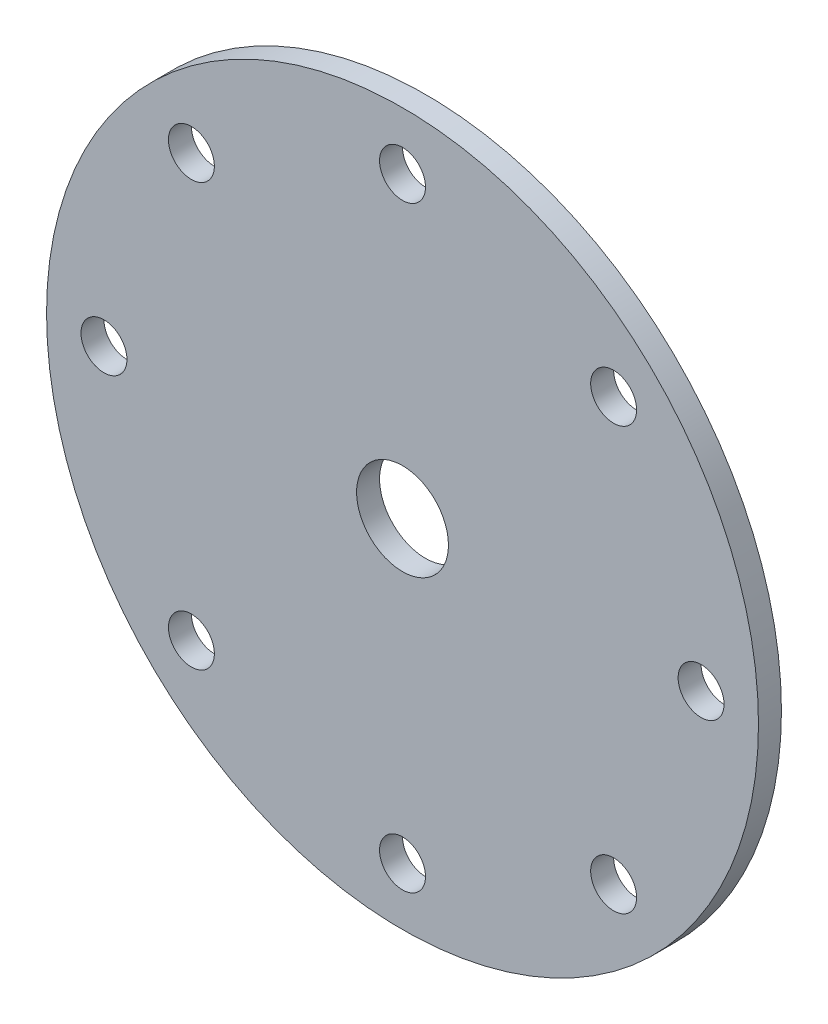
ISO-10303-21;
HEADER;
FILE_DESCRIPTION(('STEP AP214'),'2;1');
FILE_NAME('part.step','',(''),(''),'','','');
FILE_SCHEMA(('AUTOMOTIVE_DESIGN { 1 0 10303 214 1 1 1 1 }'));
ENDSEC;
DATA;
#1=APPLICATION_CONTEXT('core data for automotive mechanical design processes');
#2=APPLICATION_PROTOCOL_DEFINITION('international standard','automotive_design',2000,#1);
#3=PRODUCT_CONTEXT('',#1,'mechanical');
#4=PRODUCT('Part','Part','',(#3));
#5=PRODUCT_RELATED_PRODUCT_CATEGORY('part','',(#4));
#6=PRODUCT_DEFINITION_FORMATION('','',#4);
#7=PRODUCT_DEFINITION_CONTEXT('part definition',#1,'design');
#8=PRODUCT_DEFINITION('design','',#6,#7);
#9=PRODUCT_DEFINITION_SHAPE('','',#8);
#10=(LENGTH_UNIT() NAMED_UNIT(*) SI_UNIT(.MILLI.,.METRE.));
#11=(NAMED_UNIT(*) PLANE_ANGLE_UNIT() SI_UNIT($,.RADIAN.));
#12=(NAMED_UNIT(*) SI_UNIT($,.STERADIAN.) SOLID_ANGLE_UNIT());
#13=UNCERTAINTY_MEASURE_WITH_UNIT(LENGTH_MEASURE(1.E-05),#10,'distance_accuracy_value','');
#14=(GEOMETRIC_REPRESENTATION_CONTEXT(3) GLOBAL_UNCERTAINTY_ASSIGNED_CONTEXT((#13)) GLOBAL_UNIT_ASSIGNED_CONTEXT((#10,
#11,#12)) REPRESENTATION_CONTEXT('',''));
#15=CARTESIAN_POINT('',(0.,0.,0.));
#16=DIRECTION('',(0.,0.,1.));
#17=DIRECTION('',(1.,0.,0.));
#18=AXIS2_PLACEMENT_3D('',#15,#16,#17);
#19=CARTESIAN_POINT('',(0.,0.,6.35));
#20=DIRECTION('',(0.,0.,-1.));
#21=DIRECTION('',(-1.,0.,0.));
#22=AXIS2_PLACEMENT_3D('',#19,#20,#21);
#23=CYLINDRICAL_SURFACE('',#22,12.7);
#24=CARTESIAN_POINT('',(0.,0.,6.35));
#25=DIRECTION('',(0.,0.,1.));
#26=DIRECTION('',(1.,0.,0.));
#27=AXIS2_PLACEMENT_3D('',#24,#25,#26);
#28=CIRCLE('',#27,12.7);
#29=CARTESIAN_POINT('',(12.7,0.,6.35));
#30=VERTEX_POINT('',#29);
#31=EDGE_CURVE('E48',#30,#30,#28,.T.);
#32=ORIENTED_EDGE('',*,*,#31,.T.);
#33=EDGE_LOOP('',(#32));
#34=FACE_BOUND('',#33,.T.);
#35=CARTESIAN_POINT('',(0.,0.,0.));
#36=DIRECTION('',(0.,0.,1.));
#37=DIRECTION('',(1.,0.,0.));
#38=AXIS2_PLACEMENT_3D('',#35,#36,#37);
#39=CIRCLE('',#38,12.7);
#40=CARTESIAN_POINT('',(12.7,0.,0.));
#41=VERTEX_POINT('',#40);
#42=EDGE_CURVE('E89',#41,#41,#39,.T.);
#43=ORIENTED_EDGE('',*,*,#42,.F.);
#44=EDGE_LOOP('',(#43));
#45=FACE_BOUND('',#44,.T.);
#46=ADVANCED_FACE('F39',(#34,#45),#23,.F.);
#47=CARTESIAN_POINT('',(0.,82.55,6.35));
#48=DIRECTION('',(0.,0.,-1.));
#49=DIRECTION('',(-1.,0.,0.));
#50=AXIS2_PLACEMENT_3D('',#47,#48,#49);
#51=CYLINDRICAL_SURFACE('',#50,6.35);
#52=CARTESIAN_POINT('',(0.,82.55,6.35));
#53=DIRECTION('',(0.,0.,1.));
#54=DIRECTION('',(1.,0.,0.));
#55=AXIS2_PLACEMENT_3D('',#52,#53,#54);
#56=CIRCLE('',#55,6.35);
#57=CARTESIAN_POINT('',(6.35,82.55,6.35));
#58=VERTEX_POINT('',#57);
#59=EDGE_CURVE('E54',#58,#58,#56,.T.);
#60=ORIENTED_EDGE('',*,*,#59,.T.);
#61=EDGE_LOOP('',(#60));
#62=FACE_BOUND('',#61,.T.);
#63=CARTESIAN_POINT('',(0.,82.55,0.));
#64=DIRECTION('',(0.,0.,1.));
#65=DIRECTION('',(1.,0.,0.));
#66=AXIS2_PLACEMENT_3D('',#63,#64,#65);
#67=CIRCLE('',#66,6.35);
#68=CARTESIAN_POINT('',(6.35,82.55,0.));
#69=VERTEX_POINT('',#68);
#70=EDGE_CURVE('E86',#69,#69,#67,.T.);
#71=ORIENTED_EDGE('',*,*,#70,.F.);
#72=EDGE_LOOP('',(#71));
#73=FACE_BOUND('',#72,.T.);
#74=ADVANCED_FACE('F132',(#62,#73),#51,.F.);
#75=CARTESIAN_POINT('',(58.3716647869495,58.3716647869495,6.35));
#76=DIRECTION('',(0.,0.,-1.));
#77=DIRECTION('',(-1.,0.,0.));
#78=AXIS2_PLACEMENT_3D('',#75,#76,#77);
#79=CYLINDRICAL_SURFACE('',#78,6.35);
#80=CARTESIAN_POINT('',(58.3716647869495,58.3716647869495,6.35));
#81=DIRECTION('',(0.,0.,1.));
#82=DIRECTION('',(1.,0.,0.));
#83=AXIS2_PLACEMENT_3D('',#80,#81,#82);
#84=CIRCLE('',#83,6.35);
#85=CARTESIAN_POINT('',(64.7216647869495,58.3716647869495,6.35));
#86=VERTEX_POINT('',#85);
#87=EDGE_CURVE('E125',#86,#86,#84,.T.);
#88=ORIENTED_EDGE('',*,*,#87,.T.);
#89=EDGE_LOOP('',(#88));
#90=FACE_BOUND('',#89,.T.);
#91=CARTESIAN_POINT('',(58.3716647869495,58.3716647869495,0.));
#92=DIRECTION('',(0.,0.,1.));
#93=DIRECTION('',(1.,0.,0.));
#94=AXIS2_PLACEMENT_3D('',#91,#92,#93);
#95=CIRCLE('',#94,6.35);
#96=CARTESIAN_POINT('',(64.7216647869495,58.3716647869495,0.));
#97=VERTEX_POINT('',#96);
#98=EDGE_CURVE('E82',#97,#97,#95,.T.);
#99=ORIENTED_EDGE('',*,*,#98,.F.);
#100=EDGE_LOOP('',(#99));
#101=FACE_BOUND('',#100,.T.);
#102=ADVANCED_FACE('F150',(#90,#101),#79,.F.);
#103=CARTESIAN_POINT('',(82.55,0.,6.35));
#104=DIRECTION('',(0.,0.,-1.));
#105=DIRECTION('',(-1.,0.,0.));
#106=AXIS2_PLACEMENT_3D('',#103,#104,#105);
#107=CYLINDRICAL_SURFACE('',#106,6.35);
#108=CARTESIAN_POINT('',(82.55,0.,6.35));
#109=DIRECTION('',(0.,0.,1.));
#110=DIRECTION('',(1.,0.,0.));
#111=AXIS2_PLACEMENT_3D('',#108,#109,#110);
#112=CIRCLE('',#111,6.35);
#113=CARTESIAN_POINT('',(88.9,0.,6.35));
#114=VERTEX_POINT('',#113);
#115=EDGE_CURVE('E121',#114,#114,#112,.T.);
#116=ORIENTED_EDGE('',*,*,#115,.T.);
#117=EDGE_LOOP('',(#116));
#118=FACE_BOUND('',#117,.T.);
#119=CARTESIAN_POINT('',(82.55,0.,0.));
#120=DIRECTION('',(0.,0.,1.));
#121=DIRECTION('',(1.,0.,0.));
#122=AXIS2_PLACEMENT_3D('',#119,#120,#121);
#123=CIRCLE('',#122,6.35);
#124=CARTESIAN_POINT('',(88.9,0.,0.));
#125=VERTEX_POINT('',#124);
#126=EDGE_CURVE('E78',#125,#125,#123,.T.);
#127=ORIENTED_EDGE('',*,*,#126,.F.);
#128=EDGE_LOOP('',(#127));
#129=FACE_BOUND('',#128,.T.);
#130=ADVANCED_FACE('F157',(#118,#129),#107,.F.);
#131=CARTESIAN_POINT('',(58.3716647869495,-58.3716647869495,6.35));
#132=DIRECTION('',(0.,0.,-1.));
#133=DIRECTION('',(-1.,0.,0.));
#134=AXIS2_PLACEMENT_3D('',#131,#132,#133);
#135=CYLINDRICAL_SURFACE('',#134,6.35);
#136=CARTESIAN_POINT('',(58.3716647869495,-58.3716647869495,6.35));
#137=DIRECTION('',(0.,0.,1.));
#138=DIRECTION('',(1.,0.,0.));
#139=AXIS2_PLACEMENT_3D('',#136,#137,#138);
#140=CIRCLE('',#139,6.35);
#141=CARTESIAN_POINT('',(64.7216647869495,-58.3716647869495,6.35));
#142=VERTEX_POINT('',#141);
#143=EDGE_CURVE('E117',#142,#142,#140,.T.);
#144=ORIENTED_EDGE('',*,*,#143,.T.);
#145=EDGE_LOOP('',(#144));
#146=FACE_BOUND('',#145,.T.);
#147=CARTESIAN_POINT('',(58.3716647869495,-58.3716647869495,0.));
#148=DIRECTION('',(0.,0.,1.));
#149=DIRECTION('',(1.,0.,0.));
#150=AXIS2_PLACEMENT_3D('',#147,#148,#149);
#151=CIRCLE('',#150,6.35);
#152=CARTESIAN_POINT('',(64.7216647869495,-58.3716647869495,0.));
#153=VERTEX_POINT('',#152);
#154=EDGE_CURVE('E74',#153,#153,#151,.T.);
#155=ORIENTED_EDGE('',*,*,#154,.F.);
#156=EDGE_LOOP('',(#155));
#157=FACE_BOUND('',#156,.T.);
#158=ADVANCED_FACE('F161',(#146,#157),#135,.F.);
#159=CARTESIAN_POINT('',(0.,-82.55,6.35));
#160=DIRECTION('',(0.,0.,-1.));
#161=DIRECTION('',(-1.,0.,0.));
#162=AXIS2_PLACEMENT_3D('',#159,#160,#161);
#163=CYLINDRICAL_SURFACE('',#162,6.35);
#164=CARTESIAN_POINT('',(0.,-82.55,6.35));
#165=DIRECTION('',(0.,0.,1.));
#166=DIRECTION('',(1.,0.,0.));
#167=AXIS2_PLACEMENT_3D('',#164,#165,#166);
#168=CIRCLE('',#167,6.35);
#169=CARTESIAN_POINT('',(6.35000000000002,-82.55,6.35));
#170=VERTEX_POINT('',#169);
#171=EDGE_CURVE('E113',#170,#170,#168,.T.);
#172=ORIENTED_EDGE('',*,*,#171,.T.);
#173=EDGE_LOOP('',(#172));
#174=FACE_BOUND('',#173,.T.);
#175=CARTESIAN_POINT('',(0.,-82.55,0.));
#176=DIRECTION('',(0.,0.,1.));
#177=DIRECTION('',(1.,0.,0.));
#178=AXIS2_PLACEMENT_3D('',#175,#176,#177);
#179=CIRCLE('',#178,6.35);
#180=CARTESIAN_POINT('',(6.35000000000002,-82.55,0.));
#181=VERTEX_POINT('',#180);
#182=EDGE_CURVE('E70',#181,#181,#179,.T.);
#183=ORIENTED_EDGE('',*,*,#182,.F.);
#184=EDGE_LOOP('',(#183));
#185=FACE_BOUND('',#184,.T.);
#186=ADVANCED_FACE('F165',(#174,#185),#163,.F.);
#187=CARTESIAN_POINT('',(-58.3716647869495,-58.3716647869495,6.35));
#188=DIRECTION('',(0.,0.,-1.));
#189=DIRECTION('',(-1.,0.,0.));
#190=AXIS2_PLACEMENT_3D('',#187,#188,#189);
#191=CYLINDRICAL_SURFACE('',#190,6.35);
#192=CARTESIAN_POINT('',(-58.3716647869495,-58.3716647869495,6.35));
#193=DIRECTION('',(0.,0.,1.));
#194=DIRECTION('',(1.,0.,0.));
#195=AXIS2_PLACEMENT_3D('',#192,#193,#194);
#196=CIRCLE('',#195,6.35);
#197=CARTESIAN_POINT('',(-52.0216647869495,-58.3716647869495,6.35));
#198=VERTEX_POINT('',#197);
#199=EDGE_CURVE('E107',#198,#198,#196,.T.);
#200=ORIENTED_EDGE('',*,*,#199,.T.);
#201=EDGE_LOOP('',(#200));
#202=FACE_BOUND('',#201,.T.);
#203=CARTESIAN_POINT('',(-58.3716647869495,-58.3716647869495,0.));
#204=DIRECTION('',(0.,0.,1.));
#205=DIRECTION('',(1.,0.,0.));
#206=AXIS2_PLACEMENT_3D('',#203,#204,#205);
#207=CIRCLE('',#206,6.35);
#208=CARTESIAN_POINT('',(-52.0216647869495,-58.3716647869495,0.));
#209=VERTEX_POINT('',#208);
#210=EDGE_CURVE('E66',#209,#209,#207,.T.);
#211=ORIENTED_EDGE('',*,*,#210,.F.);
#212=EDGE_LOOP('',(#211));
#213=FACE_BOUND('',#212,.T.);
#214=ADVANCED_FACE('F169',(#202,#213),#191,.F.);
#215=CARTESIAN_POINT('',(-82.55,0.,6.35));
#216=DIRECTION('',(0.,0.,-1.));
#217=DIRECTION('',(-1.,0.,0.));
#218=AXIS2_PLACEMENT_3D('',#215,#216,#217);
#219=CYLINDRICAL_SURFACE('',#218,6.35);
#220=CARTESIAN_POINT('',(-82.55,0.,6.35));
#221=DIRECTION('',(0.,0.,1.));
#222=DIRECTION('',(1.,0.,0.));
#223=AXIS2_PLACEMENT_3D('',#220,#221,#222);
#224=CIRCLE('',#223,6.35);
#225=CARTESIAN_POINT('',(-76.2,0.,6.35));
#226=VERTEX_POINT('',#225);
#227=EDGE_CURVE('E101',#226,#226,#224,.T.);
#228=ORIENTED_EDGE('',*,*,#227,.T.);
#229=EDGE_LOOP('',(#228));
#230=FACE_BOUND('',#229,.T.);
#231=CARTESIAN_POINT('',(-82.55,0.,0.));
#232=DIRECTION('',(0.,0.,1.));
#233=DIRECTION('',(1.,0.,0.));
#234=AXIS2_PLACEMENT_3D('',#231,#232,#233);
#235=CIRCLE('',#234,6.35);
#236=CARTESIAN_POINT('',(-76.2,0.,0.));
#237=VERTEX_POINT('',#236);
#238=EDGE_CURVE('E62',#237,#237,#235,.T.);
#239=ORIENTED_EDGE('',*,*,#238,.F.);
#240=EDGE_LOOP('',(#239));
#241=FACE_BOUND('',#240,.T.);
#242=ADVANCED_FACE('F172',(#230,#241),#219,.F.);
#243=CARTESIAN_POINT('',(-58.3716647869495,58.3716647869495,6.35));
#244=DIRECTION('',(0.,0.,-1.));
#245=DIRECTION('',(-1.,0.,0.));
#246=AXIS2_PLACEMENT_3D('',#243,#244,#245);
#247=CYLINDRICAL_SURFACE('',#246,6.35);
#248=CARTESIAN_POINT('',(-58.3716647869495,58.3716647869495,6.35));
#249=DIRECTION('',(0.,0.,1.));
#250=DIRECTION('',(1.,0.,0.));
#251=AXIS2_PLACEMENT_3D('',#248,#249,#250);
#252=CIRCLE('',#251,6.35);
#253=CARTESIAN_POINT('',(-52.0216647869495,58.3716647869495,6.35));
#254=VERTEX_POINT('',#253);
#255=EDGE_CURVE('E96',#254,#254,#252,.T.);
#256=ORIENTED_EDGE('',*,*,#255,.T.);
#257=EDGE_LOOP('',(#256));
#258=FACE_BOUND('',#257,.T.);
#259=CARTESIAN_POINT('',(-58.3716647869495,58.3716647869495,0.));
#260=DIRECTION('',(0.,0.,1.));
#261=DIRECTION('',(1.,0.,0.));
#262=AXIS2_PLACEMENT_3D('',#259,#260,#261);
#263=CIRCLE('',#262,6.35);
#264=CARTESIAN_POINT('',(-52.0216647869495,58.3716647869495,0.));
#265=VERTEX_POINT('',#264);
#266=EDGE_CURVE('E58',#265,#265,#263,.T.);
#267=ORIENTED_EDGE('',*,*,#266,.F.);
#268=EDGE_LOOP('',(#267));
#269=FACE_BOUND('',#268,.T.);
#270=ADVANCED_FACE('F41',(#258,#269),#247,.F.);
#271=CARTESIAN_POINT('',(0.,0.,6.35));
#272=DIRECTION('',(0.,0.,-1.));
#273=DIRECTION('',(-1.,0.,0.));
#274=AXIS2_PLACEMENT_3D('',#271,#272,#273);
#275=CYLINDRICAL_SURFACE('',#274,98.425);
#276=CARTESIAN_POINT('',(0.,0.,6.35));
#277=DIRECTION('',(0.,0.,1.));
#278=DIRECTION('',(1.,0.,0.));
#279=AXIS2_PLACEMENT_3D('',#276,#277,#278);
#280=CIRCLE('',#279,98.425);
#281=CARTESIAN_POINT('',(98.425,0.,6.35));
#282=VERTEX_POINT('',#281);
#283=EDGE_CURVE('E10',#282,#282,#280,.T.);
#284=ORIENTED_EDGE('',*,*,#283,.F.);
#285=EDGE_LOOP('',(#284));
#286=FACE_BOUND('',#285,.T.);
#287=CARTESIAN_POINT('',(0.,0.,0.));
#288=DIRECTION('',(0.,0.,1.));
#289=DIRECTION('',(1.,0.,0.));
#290=AXIS2_PLACEMENT_3D('',#287,#288,#289);
#291=CIRCLE('',#290,98.425);
#292=CARTESIAN_POINT('',(98.425,0.,0.));
#293=VERTEX_POINT('',#292);
#294=EDGE_CURVE('E43',#293,#293,#291,.T.);
#295=ORIENTED_EDGE('',*,*,#294,.T.);
#296=EDGE_LOOP('',(#295));
#297=FACE_BOUND('',#296,.T.);
#298=ADVANCED_FACE('F139',(#286,#297),#275,.T.);
#299=CARTESIAN_POINT('',(0.,0.,6.35));
#300=DIRECTION('',(0.,0.,1.));
#301=DIRECTION('',(1.,0.,0.));
#302=AXIS2_PLACEMENT_3D('',#299,#300,#301);
#303=PLANE('',#302);
#304=ORIENTED_EDGE('',*,*,#255,.F.);
#305=EDGE_LOOP('',(#304));
#306=FACE_BOUND('',#305,.T.);
#307=ORIENTED_EDGE('',*,*,#227,.F.);
#308=EDGE_LOOP('',(#307));
#309=FACE_BOUND('',#308,.T.);
#310=ORIENTED_EDGE('',*,*,#199,.F.);
#311=EDGE_LOOP('',(#310));
#312=FACE_BOUND('',#311,.T.);
#313=ORIENTED_EDGE('',*,*,#171,.F.);
#314=EDGE_LOOP('',(#313));
#315=FACE_BOUND('',#314,.T.);
#316=ORIENTED_EDGE('',*,*,#143,.F.);
#317=EDGE_LOOP('',(#316));
#318=FACE_BOUND('',#317,.T.);
#319=ORIENTED_EDGE('',*,*,#115,.F.);
#320=EDGE_LOOP('',(#319));
#321=FACE_BOUND('',#320,.T.);
#322=ORIENTED_EDGE('',*,*,#87,.F.);
#323=EDGE_LOOP('',(#322));
#324=FACE_BOUND('',#323,.T.);
#325=ORIENTED_EDGE('',*,*,#59,.F.);
#326=EDGE_LOOP('',(#325));
#327=FACE_BOUND('',#326,.T.);
#328=ORIENTED_EDGE('',*,*,#31,.F.);
#329=EDGE_LOOP('',(#328));
#330=FACE_BOUND('',#329,.T.);
#331=ORIENTED_EDGE('',*,*,#283,.T.);
#332=EDGE_LOOP('',(#331));
#333=FACE_BOUND('',#332,.T.);
#334=ADVANCED_FACE('F135',(#306,#309,#312,#315,#318,#321,#324,#327,#330,#333),#303,.T.);
#335=CARTESIAN_POINT('',(0.,0.,0.));
#336=DIRECTION('',(0.,0.,1.));
#337=DIRECTION('',(1.,0.,0.));
#338=AXIS2_PLACEMENT_3D('',#335,#336,#337);
#339=PLANE('',#338);
#340=ORIENTED_EDGE('',*,*,#266,.T.);
#341=EDGE_LOOP('',(#340));
#342=FACE_BOUND('',#341,.T.);
#343=ORIENTED_EDGE('',*,*,#238,.T.);
#344=EDGE_LOOP('',(#343));
#345=FACE_BOUND('',#344,.T.);
#346=ORIENTED_EDGE('',*,*,#210,.T.);
#347=EDGE_LOOP('',(#346));
#348=FACE_BOUND('',#347,.T.);
#349=ORIENTED_EDGE('',*,*,#182,.T.);
#350=EDGE_LOOP('',(#349));
#351=FACE_BOUND('',#350,.T.);
#352=ORIENTED_EDGE('',*,*,#154,.T.);
#353=EDGE_LOOP('',(#352));
#354=FACE_BOUND('',#353,.T.);
#355=ORIENTED_EDGE('',*,*,#126,.T.);
#356=EDGE_LOOP('',(#355));
#357=FACE_BOUND('',#356,.T.);
#358=ORIENTED_EDGE('',*,*,#98,.T.);
#359=EDGE_LOOP('',(#358));
#360=FACE_BOUND('',#359,.T.);
#361=ORIENTED_EDGE('',*,*,#70,.T.);
#362=EDGE_LOOP('',(#361));
#363=FACE_BOUND('',#362,.T.);
#364=ORIENTED_EDGE('',*,*,#42,.T.);
#365=EDGE_LOOP('',(#364));
#366=FACE_BOUND('',#365,.T.);
#367=ORIENTED_EDGE('',*,*,#294,.F.);
#368=EDGE_LOOP('',(#367));
#369=FACE_BOUND('',#368,.T.);
#370=ADVANCED_FACE('F138',(#342,#345,#348,#351,#354,#357,#360,#363,#366,#369),#339,.F.);
#371=CLOSED_SHELL('',(#46,#74,#102,#130,#158,#186,#214,#242,#270,#298,#334,#370));
#372=MANIFOLD_SOLID_BREP('B2',#371);
#373=ADVANCED_BREP_SHAPE_REPRESENTATION('',(#18,#372),#14);
#374=SHAPE_DEFINITION_REPRESENTATION(#9,#373);
ENDSEC;
END-ISO-10303-21;
